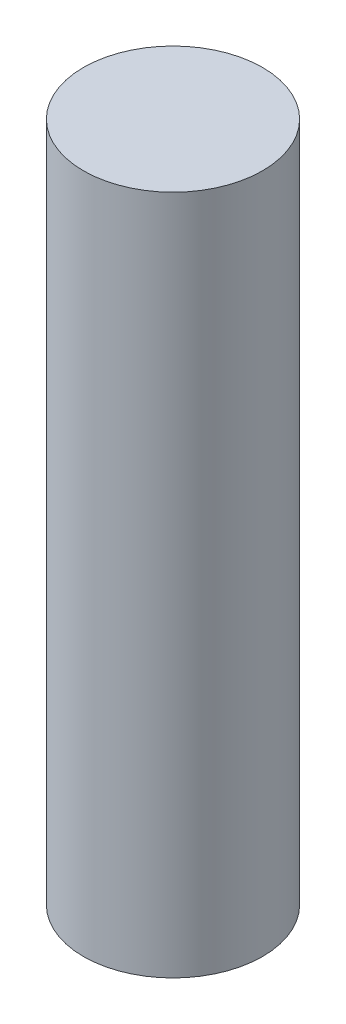
ISO-10303-21;
HEADER;
FILE_DESCRIPTION(('STEP AP214'),'2;1');
FILE_NAME('part.step','',(''),(''),'','','');
FILE_SCHEMA(('AUTOMOTIVE_DESIGN { 1 0 10303 214 1 1 1 1 }'));
ENDSEC;
DATA;
#1=APPLICATION_CONTEXT('core data for automotive mechanical design processes');
#2=APPLICATION_PROTOCOL_DEFINITION('international standard','automotive_design',2000,#1);
#3=PRODUCT_CONTEXT('',#1,'mechanical');
#4=PRODUCT('Part','Part','',(#3));
#5=PRODUCT_RELATED_PRODUCT_CATEGORY('part','',(#4));
#6=PRODUCT_DEFINITION_FORMATION('','',#4);
#7=PRODUCT_DEFINITION_CONTEXT('part definition',#1,'design');
#8=PRODUCT_DEFINITION('design','',#6,#7);
#9=PRODUCT_DEFINITION_SHAPE('','',#8);
#10=(LENGTH_UNIT() NAMED_UNIT(*) SI_UNIT(.MILLI.,.METRE.));
#11=(NAMED_UNIT(*) PLANE_ANGLE_UNIT() SI_UNIT($,.RADIAN.));
#12=(NAMED_UNIT(*) SI_UNIT($,.STERADIAN.) SOLID_ANGLE_UNIT());
#13=UNCERTAINTY_MEASURE_WITH_UNIT(LENGTH_MEASURE(1.E-05),#10,'distance_accuracy_value','');
#14=(GEOMETRIC_REPRESENTATION_CONTEXT(3) GLOBAL_UNCERTAINTY_ASSIGNED_CONTEXT((#13)) GLOBAL_UNIT_ASSIGNED_CONTEXT((#10,
#11,#12)) REPRESENTATION_CONTEXT('',''));
#15=CARTESIAN_POINT('',(0.,0.,0.));
#16=DIRECTION('',(0.,0.,1.));
#17=DIRECTION('',(1.,0.,0.));
#18=AXIS2_PLACEMENT_3D('',#15,#16,#17);
#19=CARTESIAN_POINT('',(0.,96.52,0.));
#20=DIRECTION('',(0.,-1.,0.));
#21=DIRECTION('',(0.,0.,-1.));
#22=AXIS2_PLACEMENT_3D('',#19,#20,#21);
#23=CYLINDRICAL_SURFACE('',#22,12.7);
#24=CARTESIAN_POINT('',(0.,96.52,0.));
#25=DIRECTION('',(0.,1.,0.));
#26=DIRECTION('',(0.,0.,1.));
#27=AXIS2_PLACEMENT_3D('',#24,#25,#26);
#28=CIRCLE('',#27,12.7);
#29=CARTESIAN_POINT('',(0.,96.52,12.7));
#30=VERTEX_POINT('',#29);
#31=EDGE_CURVE('E10',#30,#30,#28,.T.);
#32=ORIENTED_EDGE('',*,*,#31,.F.);
#33=EDGE_LOOP('',(#32));
#34=FACE_BOUND('',#33,.T.);
#35=CARTESIAN_POINT('',(0.,0.,0.));
#36=DIRECTION('',(0.,1.,0.));
#37=DIRECTION('',(0.,0.,1.));
#38=AXIS2_PLACEMENT_3D('',#35,#36,#37);
#39=CIRCLE('',#38,12.7);
#40=CARTESIAN_POINT('',(0.,0.,12.7));
#41=VERTEX_POINT('',#40);
#42=EDGE_CURVE('E39',#41,#41,#39,.T.);
#43=ORIENTED_EDGE('',*,*,#42,.T.);
#44=EDGE_LOOP('',(#43));
#45=FACE_BOUND('',#44,.T.);
#46=ADVANCED_FACE('F36',(#34,#45),#23,.T.);
#47=CARTESIAN_POINT('',(0.,96.52,0.));
#48=DIRECTION('',(0.,1.,0.));
#49=DIRECTION('',(0.,0.,1.));
#50=AXIS2_PLACEMENT_3D('',#47,#48,#49);
#51=PLANE('',#50);
#52=ORIENTED_EDGE('',*,*,#31,.T.);
#53=EDGE_LOOP('',(#52));
#54=FACE_BOUND('',#53,.T.);
#55=ADVANCED_FACE('F51',(#54),#51,.T.);
#56=CARTESIAN_POINT('',(0.,0.,0.));
#57=DIRECTION('',(0.,1.,0.));
#58=DIRECTION('',(0.,0.,1.));
#59=AXIS2_PLACEMENT_3D('',#56,#57,#58);
#60=PLANE('',#59);
#61=ORIENTED_EDGE('',*,*,#42,.F.);
#62=EDGE_LOOP('',(#61));
#63=FACE_BOUND('',#62,.T.);
#64=ADVANCED_FACE('F49',(#63),#60,.F.);
#65=CLOSED_SHELL('',(#46,#55,#64));
#66=MANIFOLD_SOLID_BREP('B2',#65);
#67=ADVANCED_BREP_SHAPE_REPRESENTATION('',(#18,#66),#14);
#68=SHAPE_DEFINITION_REPRESENTATION(#9,#67);
ENDSEC;
END-ISO-10303-21;
